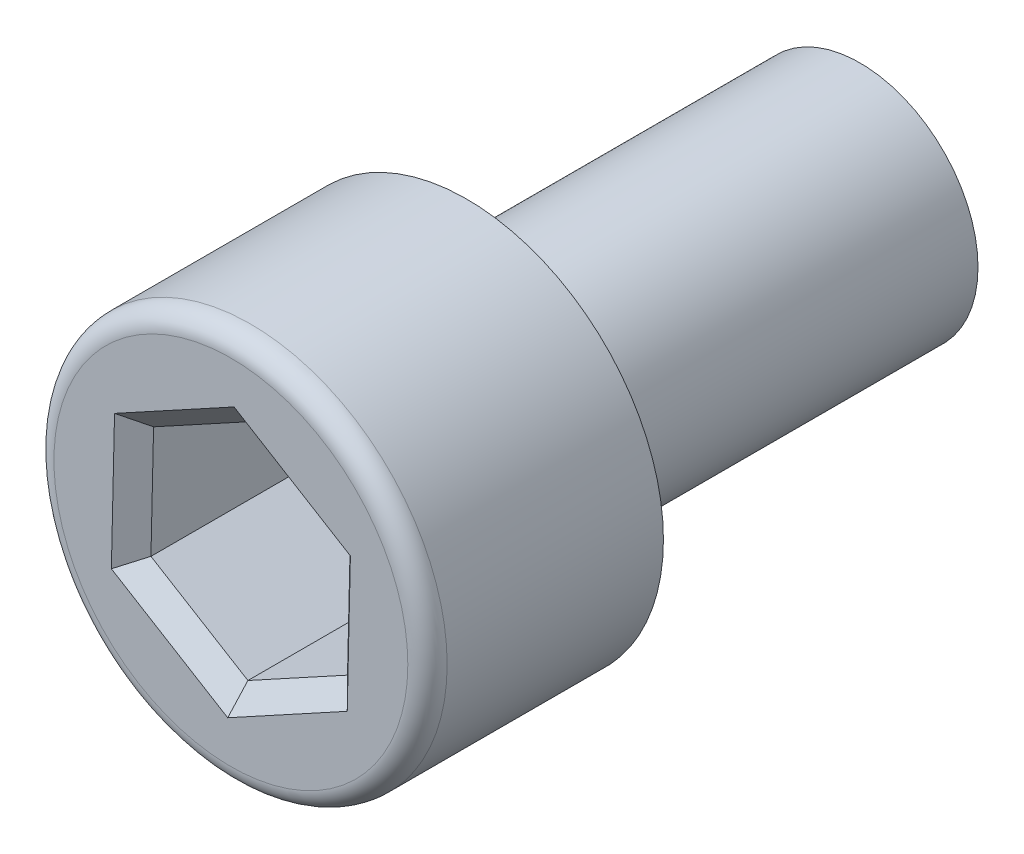
ISO-10303-21;
HEADER;
FILE_DESCRIPTION(('STEP AP214'),'2;1');
FILE_NAME('part.step','',(''),(''),'','','');
FILE_SCHEMA(('AUTOMOTIVE_DESIGN { 1 0 10303 214 1 1 1 1 }'));
ENDSEC;
DATA;
#1=APPLICATION_CONTEXT('core data for automotive mechanical design processes');
#2=APPLICATION_PROTOCOL_DEFINITION('international standard','automotive_design',2000,#1);
#3=PRODUCT_CONTEXT('',#1,'mechanical');
#4=PRODUCT('Part','Part','',(#3));
#5=PRODUCT_RELATED_PRODUCT_CATEGORY('part','',(#4));
#6=PRODUCT_DEFINITION_FORMATION('','',#4);
#7=PRODUCT_DEFINITION_CONTEXT('part definition',#1,'design');
#8=PRODUCT_DEFINITION('design','',#6,#7);
#9=PRODUCT_DEFINITION_SHAPE('','',#8);
#10=(LENGTH_UNIT() NAMED_UNIT(*) SI_UNIT(.MILLI.,.METRE.));
#11=(NAMED_UNIT(*) PLANE_ANGLE_UNIT() SI_UNIT($,.RADIAN.));
#12=(NAMED_UNIT(*) SI_UNIT($,.STERADIAN.) SOLID_ANGLE_UNIT());
#13=UNCERTAINTY_MEASURE_WITH_UNIT(LENGTH_MEASURE(1.E-05),#10,'distance_accuracy_value','');
#14=(GEOMETRIC_REPRESENTATION_CONTEXT(3) GLOBAL_UNCERTAINTY_ASSIGNED_CONTEXT((#13)) GLOBAL_UNIT_ASSIGNED_CONTEXT((#10,
#11,#12)) REPRESENTATION_CONTEXT('',''));
#15=CARTESIAN_POINT('',(0.,0.,0.));
#16=DIRECTION('',(0.,0.,1.));
#17=DIRECTION('',(1.,0.,0.));
#18=AXIS2_PLACEMENT_3D('',#15,#16,#17);
#19=CARTESIAN_POINT('',(0.,0.,-10.));
#20=DIRECTION('',(0.,0.,1.));
#21=DIRECTION('',(1.,0.,0.));
#22=AXIS2_PLACEMENT_3D('',#19,#20,#21);
#23=CYLINDRICAL_SURFACE('',#22,3.);
#24=CARTESIAN_POINT('',(0.,0.,-10.));
#25=DIRECTION('',(0.,0.,1.));
#26=DIRECTION('',(1.,0.,0.));
#27=AXIS2_PLACEMENT_3D('',#24,#25,#26);
#28=CIRCLE('',#27,3.);
#29=CARTESIAN_POINT('',(3.,0.,-10.));
#30=VERTEX_POINT('',#29);
#31=EDGE_CURVE('E158',#30,#30,#28,.T.);
#32=ORIENTED_EDGE('',*,*,#31,.T.);
#33=EDGE_LOOP('',(#32));
#34=FACE_BOUND('',#33,.T.);
#35=CARTESIAN_POINT('',(0.,0.,0.));
#36=DIRECTION('',(0.,0.,1.));
#37=DIRECTION('',(1.,0.,0.));
#38=AXIS2_PLACEMENT_3D('',#35,#36,#37);
#39=CIRCLE('',#38,3.);
#40=CARTESIAN_POINT('',(3.,0.,0.));
#41=VERTEX_POINT('',#40);
#42=EDGE_CURVE('E155',#41,#41,#39,.T.);
#43=ORIENTED_EDGE('',*,*,#42,.F.);
#44=EDGE_LOOP('',(#43));
#45=FACE_BOUND('',#44,.T.);
#46=ADVANCED_FACE('F34',(#34,#45),#23,.T.);
#47=CARTESIAN_POINT('',(0.,0.,-10.));
#48=DIRECTION('',(0.,0.,1.));
#49=DIRECTION('',(1.,0.,0.));
#50=AXIS2_PLACEMENT_3D('',#47,#48,#49);
#51=PLANE('',#50);
#52=ORIENTED_EDGE('',*,*,#31,.F.);
#53=EDGE_LOOP('',(#52));
#54=FACE_BOUND('',#53,.T.);
#55=ADVANCED_FACE('F252',(#54),#51,.F.);
#56=CARTESIAN_POINT('',(0.,0.,6.));
#57=DIRECTION('',(0.,0.,-1.));
#58=DIRECTION('',(-1.,0.,0.));
#59=AXIS2_PLACEMENT_3D('',#56,#57,#58);
#60=CYLINDRICAL_SURFACE('',#59,5.);
#61=CARTESIAN_POINT('',(0.,0.,5.5));
#62=DIRECTION('',(0.,0.,1.));
#63=DIRECTION('',(1.,0.,0.));
#64=AXIS2_PLACEMENT_3D('',#61,#62,#63);
#65=CIRCLE('',#64,5.);
#66=CARTESIAN_POINT('',(5.,0.,5.5));
#67=VERTEX_POINT('',#66);
#68=EDGE_CURVE('E164',#67,#67,#65,.F.);
#69=ORIENTED_EDGE('',*,*,#68,.T.);
#70=EDGE_LOOP('',(#69));
#71=FACE_BOUND('',#70,.T.);
#72=CARTESIAN_POINT('',(0.,0.,0.));
#73=DIRECTION('',(0.,0.,1.));
#74=DIRECTION('',(1.,0.,0.));
#75=AXIS2_PLACEMENT_3D('',#72,#73,#74);
#76=CIRCLE('',#75,5.);
#77=CARTESIAN_POINT('',(5.,0.,0.));
#78=VERTEX_POINT('',#77);
#79=EDGE_CURVE('E144',#78,#78,#76,.T.);
#80=ORIENTED_EDGE('',*,*,#79,.T.);
#81=EDGE_LOOP('',(#80));
#82=FACE_BOUND('',#81,.T.);
#83=ADVANCED_FACE('F236',(#71,#82),#60,.T.);
#84=CARTESIAN_POINT('',(0.,0.,6.));
#85=DIRECTION('',(0.,0.,1.));
#86=DIRECTION('',(1.,0.,0.));
#87=AXIS2_PLACEMENT_3D('',#84,#85,#86);
#88=PLANE('',#87);
#89=DIRECTION('',(-0.854139669217899,0.520043676500676,0.));
#90=VECTOR('',#89,1.);
#91=CARTESIAN_POINT('',(-2.79297544937326,-1.81180061610863,6.));
#92=LINE('',#91,#90);
#93=CARTESIAN_POINT('',(-0.0807177256565525,-3.46316107750778,6.));
#94=VERTEX_POINT('',#93);
#95=CARTESIAN_POINT('',(-3.03954433334751,-1.66167693779962,6.));
#96=VERTEX_POINT('',#95);
#97=EDGE_CURVE('E177',#94,#96,#92,.T.);
#98=ORIENTED_EDGE('',*,*,#97,.T.);
#99=DIRECTION('',(0.0233012003180923,0.999728490173075,0.));
#100=VECTOR('',#99,1.);
#101=CARTESIAN_POINT('',(-2.965553084829,1.51288738324918,6.));
#102=LINE('',#101,#100);
#103=CARTESIAN_POINT('',(-2.95882660769095,1.80148413970817,6.));
#104=VERTEX_POINT('',#103);
#105=EDGE_CURVE('E179',#96,#104,#102,.T.);
#106=ORIENTED_EDGE('',*,*,#105,.T.);
#107=DIRECTION('',(0.877440869535991,0.4796848136724,0.));
#108=VECTOR('',#107,1.);
#109=CARTESIAN_POINT('',(-0.172577635455743,3.32468799935781,6.));
#110=LINE('',#109,#108);
#111=CARTESIAN_POINT('',(0.0807177256565515,3.46316107750778,6.));
#112=VERTEX_POINT('',#111);
#113=EDGE_CURVE('E169',#104,#112,#110,.T.);
#114=ORIENTED_EDGE('',*,*,#113,.T.);
#115=DIRECTION('',(0.854139669217899,-0.520043676500675,0.));
#116=VECTOR('',#115,1.);
#117=CARTESIAN_POINT('',(2.79297544937326,1.81180061610863,6.));
#118=LINE('',#117,#116);
#119=CARTESIAN_POINT('',(3.0395443333475,1.66167693779962,6.));
#120=VERTEX_POINT('',#119);
#121=EDGE_CURVE('E171',#112,#120,#118,.T.);
#122=ORIENTED_EDGE('',*,*,#121,.T.);
#123=DIRECTION('',(-0.023301200318092,-0.999728490173075,0.));
#124=VECTOR('',#123,1.);
#125=CARTESIAN_POINT('',(2.965553084829,-1.51288738324918,6.));
#126=LINE('',#125,#124);
#127=CARTESIAN_POINT('',(2.95882660769095,-1.80148413970817,6.));
#128=VERTEX_POINT('',#127);
#129=EDGE_CURVE('E173',#120,#128,#126,.T.);
#130=ORIENTED_EDGE('',*,*,#129,.T.);
#131=DIRECTION('',(-0.877440869535991,-0.4796848136724,0.));
#132=VECTOR('',#131,1.);
#133=CARTESIAN_POINT('',(0.172577635455742,-3.32468799935782,6.));
#134=LINE('',#133,#132);
#135=EDGE_CURVE('E175',#128,#94,#134,.T.);
#136=ORIENTED_EDGE('',*,*,#135,.T.);
#137=EDGE_LOOP('',(#98,#106,#114,#122,#130,#136));
#138=FACE_BOUND('',#137,.T.);
#139=CARTESIAN_POINT('',(0.,0.,6.));
#140=DIRECTION('',(0.,0.,1.));
#141=DIRECTION('',(1.,0.,0.));
#142=AXIS2_PLACEMENT_3D('',#139,#140,#141);
#143=CIRCLE('',#142,4.5);
#144=CARTESIAN_POINT('',(4.5,0.,6.));
#145=VERTEX_POINT('',#144);
#146=EDGE_CURVE('E161',#145,#145,#143,.T.);
#147=ORIENTED_EDGE('',*,*,#146,.T.);
#148=EDGE_LOOP('',(#147));
#149=FACE_BOUND('',#148,.T.);
#150=ADVANCED_FACE('F232',(#138,#149),#88,.T.);
#151=CARTESIAN_POINT('',(0.,0.,0.));
#152=DIRECTION('',(0.,0.,1.));
#153=DIRECTION('',(1.,0.,0.));
#154=AXIS2_PLACEMENT_3D('',#151,#152,#153);
#155=PLANE('',#154);
#156=ORIENTED_EDGE('',*,*,#42,.T.);
#157=EDGE_LOOP('',(#156));
#158=FACE_BOUND('',#157,.T.);
#159=ORIENTED_EDGE('',*,*,#79,.F.);
#160=EDGE_LOOP('',(#159));
#161=FACE_BOUND('',#160,.T.);
#162=ADVANCED_FACE('F235',(#158,#161),#155,.F.);
#163=CARTESIAN_POINT('',(0.0672647713804591,2.88596756458981,0.));
#164=DIRECTION('',(-0.4796848136724,0.877440869535991,0.));
#165=DIRECTION('',(-0.877440869535991,-0.4796848136724,0.));
#166=AXIS2_PLACEMENT_3D('',#163,#164,#165);
#167=PLANE('',#166);
#168=DIRECTION('',(0.,0.,1.));
#169=VECTOR('',#168,1.);
#170=CARTESIAN_POINT('',(0.0672647713804591,2.88596756458981,0.));
#171=LINE('',#170,#169);
#172=CARTESIAN_POINT('',(0.0672647713804591,2.88596756458981,0.));
#173=VERTEX_POINT('',#172);
#174=CARTESIAN_POINT('',(0.0672647713804591,2.88596756458981,5.5));
#175=VERTEX_POINT('',#174);
#176=EDGE_CURVE('E142',#173,#175,#171,.T.);
#177=ORIENTED_EDGE('',*,*,#176,.T.);
#178=DIRECTION('',(-0.877440869535991,-0.4796848136724,0.));
#179=VECTOR('',#178,1.);
#180=CARTESIAN_POINT('',(-2.46568883974246,1.50123678309014,5.5));
#181=LINE('',#180,#179);
#182=CARTESIAN_POINT('',(-2.46568883974246,1.50123678309014,5.5));
#183=VERTEX_POINT('',#182);
#184=EDGE_CURVE('E11',#175,#183,#181,.T.);
#185=ORIENTED_EDGE('',*,*,#184,.T.);
#186=DIRECTION('',(0.,0.,1.));
#187=VECTOR('',#186,1.);
#188=CARTESIAN_POINT('',(-2.46568883974246,1.50123678309014,0.));
#189=LINE('',#188,#187);
#190=CARTESIAN_POINT('',(-2.46568883974246,1.50123678309014,0.));
#191=VERTEX_POINT('',#190);
#192=EDGE_CURVE('E103',#191,#183,#189,.T.);
#193=ORIENTED_EDGE('',*,*,#192,.F.);
#194=DIRECTION('',(-0.877440869535991,-0.4796848136724,0.));
#195=VECTOR('',#194,1.);
#196=CARTESIAN_POINT('',(0.0672647713804591,2.88596756458981,0.));
#197=LINE('',#196,#195);
#198=EDGE_CURVE('E107',#173,#191,#197,.T.);
#199=ORIENTED_EDGE('',*,*,#198,.F.);
#200=EDGE_LOOP('',(#177,#185,#193,#199));
#201=FACE_BOUND('',#200,.T.);
#202=ADVANCED_FACE('F105',(#201),#167,.F.);
#203=CARTESIAN_POINT('',(2.53295361112292,1.38473078149968,0.));
#204=DIRECTION('',(0.520043676500675,0.854139669217899,0.));
#205=DIRECTION('',(-0.854139669217899,0.520043676500675,0.));
#206=AXIS2_PLACEMENT_3D('',#203,#204,#205);
#207=PLANE('',#206);
#208=DIRECTION('',(0.,0.,1.));
#209=VECTOR('',#208,1.);
#210=CARTESIAN_POINT('',(2.53295361112292,1.38473078149968,0.));
#211=LINE('',#210,#209);
#212=CARTESIAN_POINT('',(2.53295361112292,1.38473078149968,0.));
#213=VERTEX_POINT('',#212);
#214=CARTESIAN_POINT('',(2.53295361112292,1.38473078149968,5.5));
#215=VERTEX_POINT('',#214);
#216=EDGE_CURVE('E145',#213,#215,#211,.T.);
#217=ORIENTED_EDGE('',*,*,#216,.T.);
#218=DIRECTION('',(-0.854139669217899,0.520043676500675,0.));
#219=VECTOR('',#218,1.);
#220=CARTESIAN_POINT('',(0.0672647713804589,2.88596756458981,5.5));
#221=LINE('',#220,#219);
#222=EDGE_CURVE('E41',#215,#175,#221,.T.);
#223=ORIENTED_EDGE('',*,*,#222,.T.);
#224=ORIENTED_EDGE('',*,*,#176,.F.);
#225=DIRECTION('',(-0.854139669217899,0.520043676500675,0.));
#226=VECTOR('',#225,1.);
#227=CARTESIAN_POINT('',(2.53295361112292,1.38473078149968,0.));
#228=LINE('',#227,#226);
#229=EDGE_CURVE('E114',#213,#173,#228,.T.);
#230=ORIENTED_EDGE('',*,*,#229,.F.);
#231=EDGE_LOOP('',(#217,#223,#224,#230));
#232=FACE_BOUND('',#231,.T.);
#233=ADVANCED_FACE('F223',(#232),#207,.F.);
#234=CARTESIAN_POINT('',(2.46568883974246,-1.50123678309014,0.));
#235=DIRECTION('',(0.999728490173075,-0.023301200318092,0.));
#236=DIRECTION('',(0.023301200318092,0.999728490173075,0.));
#237=AXIS2_PLACEMENT_3D('',#234,#235,#236);
#238=PLANE('',#237);
#239=DIRECTION('',(0.,0.,1.));
#240=VECTOR('',#239,1.);
#241=CARTESIAN_POINT('',(2.46568883974246,-1.50123678309014,0.));
#242=LINE('',#241,#240);
#243=CARTESIAN_POINT('',(2.46568883974246,-1.50123678309014,0.));
#244=VERTEX_POINT('',#243);
#245=CARTESIAN_POINT('',(2.46568883974246,-1.50123678309014,5.5));
#246=VERTEX_POINT('',#245);
#247=EDGE_CURVE('E147',#244,#246,#242,.T.);
#248=ORIENTED_EDGE('',*,*,#247,.T.);
#249=DIRECTION('',(0.023301200318092,0.999728490173075,0.));
#250=VECTOR('',#249,1.);
#251=CARTESIAN_POINT('',(2.53295361112292,1.38473078149968,5.5));
#252=LINE('',#251,#250);
#253=EDGE_CURVE('E55',#246,#215,#252,.T.);
#254=ORIENTED_EDGE('',*,*,#253,.T.);
#255=ORIENTED_EDGE('',*,*,#216,.F.);
#256=DIRECTION('',(0.023301200318092,0.999728490173075,0.));
#257=VECTOR('',#256,1.);
#258=CARTESIAN_POINT('',(2.46568883974246,-1.50123678309014,0.));
#259=LINE('',#258,#257);
#260=EDGE_CURVE('E139',#244,#213,#259,.T.);
#261=ORIENTED_EDGE('',*,*,#260,.F.);
#262=EDGE_LOOP('',(#248,#254,#255,#261));
#263=FACE_BOUND('',#262,.T.);
#264=ADVANCED_FACE('F195',(#263),#238,.F.);
#265=CARTESIAN_POINT('',(-0.0672647713804604,-2.88596756458982,0.));
#266=DIRECTION('',(0.4796848136724,-0.87744086953599,0.));
#267=DIRECTION('',(0.877440869535991,0.4796848136724,0.));
#268=AXIS2_PLACEMENT_3D('',#265,#266,#267);
#269=PLANE('',#268);
#270=DIRECTION('',(0.,0.,1.));
#271=VECTOR('',#270,1.);
#272=CARTESIAN_POINT('',(-0.0672647713804604,-2.88596756458982,0.));
#273=LINE('',#272,#271);
#274=CARTESIAN_POINT('',(-0.0672647713804604,-2.88596756458982,0.));
#275=VERTEX_POINT('',#274);
#276=CARTESIAN_POINT('',(-0.0672647713804604,-2.88596756458982,5.5));
#277=VERTEX_POINT('',#276);
#278=EDGE_CURVE('E149',#275,#277,#273,.T.);
#279=ORIENTED_EDGE('',*,*,#278,.T.);
#280=DIRECTION('',(0.877440869535991,0.4796848136724,0.));
#281=VECTOR('',#280,1.);
#282=CARTESIAN_POINT('',(2.46568883974246,-1.50123678309014,5.5));
#283=LINE('',#282,#281);
#284=EDGE_CURVE('E184',#277,#246,#283,.T.);
#285=ORIENTED_EDGE('',*,*,#284,.T.);
#286=ORIENTED_EDGE('',*,*,#247,.F.);
#287=DIRECTION('',(0.877440869535991,0.4796848136724,0.));
#288=VECTOR('',#287,1.);
#289=CARTESIAN_POINT('',(-0.0672647713804604,-2.88596756458982,0.));
#290=LINE('',#289,#288);
#291=EDGE_CURVE('E136',#275,#244,#290,.T.);
#292=ORIENTED_EDGE('',*,*,#291,.F.);
#293=EDGE_LOOP('',(#279,#285,#286,#292));
#294=FACE_BOUND('',#293,.T.);
#295=ADVANCED_FACE('F188',(#294),#269,.F.);
#296=CARTESIAN_POINT('',(-2.53295361112292,-1.38473078149968,0.));
#297=DIRECTION('',(-0.520043676500675,-0.854139669217898,0.));
#298=DIRECTION('',(0.854139669217899,-0.520043676500676,0.));
#299=AXIS2_PLACEMENT_3D('',#296,#297,#298);
#300=PLANE('',#299);
#301=DIRECTION('',(0.,0.,1.));
#302=VECTOR('',#301,1.);
#303=CARTESIAN_POINT('',(-2.53295361112292,-1.38473078149968,0.));
#304=LINE('',#303,#302);
#305=CARTESIAN_POINT('',(-2.53295361112292,-1.38473078149968,0.));
#306=VERTEX_POINT('',#305);
#307=CARTESIAN_POINT('',(-2.53295361112292,-1.38473078149968,5.5));
#308=VERTEX_POINT('',#307);
#309=EDGE_CURVE('E113',#306,#308,#304,.T.);
#310=ORIENTED_EDGE('',*,*,#309,.T.);
#311=DIRECTION('',(0.854139669217899,-0.520043676500676,0.));
#312=VECTOR('',#311,1.);
#313=CARTESIAN_POINT('',(-0.0672647713804605,-2.88596756458982,5.5));
#314=LINE('',#313,#312);
#315=EDGE_CURVE('E182',#308,#277,#314,.T.);
#316=ORIENTED_EDGE('',*,*,#315,.T.);
#317=ORIENTED_EDGE('',*,*,#278,.F.);
#318=DIRECTION('',(0.854139669217898,-0.520043676500675,0.));
#319=VECTOR('',#318,1.);
#320=CARTESIAN_POINT('',(-2.53295361112292,-1.38473078149968,0.));
#321=LINE('',#320,#319);
#322=EDGE_CURVE('E123',#306,#275,#321,.T.);
#323=ORIENTED_EDGE('',*,*,#322,.F.);
#324=EDGE_LOOP('',(#310,#316,#317,#323));
#325=FACE_BOUND('',#324,.T.);
#326=ADVANCED_FACE('F222',(#325),#300,.F.);
#327=CARTESIAN_POINT('',(-2.46568883974246,1.50123678309014,0.));
#328=DIRECTION('',(-0.999728490173075,0.0233012003180923,0.));
#329=DIRECTION('',(-0.0233012003180923,-0.999728490173075,0.));
#330=AXIS2_PLACEMENT_3D('',#327,#328,#329);
#331=PLANE('',#330);
#332=ORIENTED_EDGE('',*,*,#192,.T.);
#333=DIRECTION('',(-0.0233012003180923,-0.999728490173075,0.));
#334=VECTOR('',#333,1.);
#335=CARTESIAN_POINT('',(-2.53295361112292,-1.38473078149968,5.5));
#336=LINE('',#335,#334);
#337=EDGE_CURVE('E167',#183,#308,#336,.T.);
#338=ORIENTED_EDGE('',*,*,#337,.T.);
#339=ORIENTED_EDGE('',*,*,#309,.F.);
#340=DIRECTION('',(-0.0233012003180923,-0.999728490173075,0.));
#341=VECTOR('',#340,1.);
#342=CARTESIAN_POINT('',(-2.46568883974246,1.50123678309014,0.));
#343=LINE('',#342,#341);
#344=EDGE_CURVE('E117',#191,#306,#343,.T.);
#345=ORIENTED_EDGE('',*,*,#344,.F.);
#346=EDGE_LOOP('',(#332,#338,#339,#345));
#347=FACE_BOUND('',#346,.T.);
#348=ADVANCED_FACE('F118',(#347),#331,.F.);
#349=CARTESIAN_POINT('',(-4.99864245086537,0.11650600159046,0.));
#350=DIRECTION('',(0.,0.,1.));
#351=DIRECTION('',(1.,0.,0.));
#352=AXIS2_PLACEMENT_3D('',#349,#350,#351);
#353=PLANE('',#352);
#354=ORIENTED_EDGE('',*,*,#198,.T.);
#355=ORIENTED_EDGE('',*,*,#344,.T.);
#356=ORIENTED_EDGE('',*,*,#322,.T.);
#357=ORIENTED_EDGE('',*,*,#291,.T.);
#358=ORIENTED_EDGE('',*,*,#260,.T.);
#359=ORIENTED_EDGE('',*,*,#229,.T.);
#360=EDGE_LOOP('',(#354,#355,#356,#357,#358,#359));
#361=FACE_BOUND('',#360,.T.);
#362=ADVANCED_FACE('F125',(#361),#353,.T.);
#363=CARTESIAN_POINT('',(0.,0.,5.5));
#364=DIRECTION('',(0.,0.,1.));
#365=DIRECTION('',(1.,0.,0.));
#366=AXIS2_PLACEMENT_3D('',#363,#364,#365);
#367=TOROIDAL_SURFACE('',#366,4.5,0.5);
#368=ORIENTED_EDGE('',*,*,#68,.F.);
#369=EDGE_LOOP('',(#368));
#370=FACE_BOUND('',#369,.T.);
#371=ORIENTED_EDGE('',*,*,#146,.F.);
#372=EDGE_LOOP('',(#371));
#373=FACE_BOUND('',#372,.T.);
#374=ADVANCED_FACE('F240',(#370,#373),#367,.T.);
#375=CARTESIAN_POINT('',(2.46568883974246,-1.50123678309014,5.5));
#376=DIRECTION('',(-0.706914794746768,0.016476436754709,0.707106781186549));
#377=DIRECTION('',(0.707202780921329,0.,0.707010768416677));
#378=AXIS2_PLACEMENT_3D('',#375,#376,#377);
#379=PLANE('',#378);
#380=DIRECTION('',(0.645668899904438,-0.393116068260719,0.654653670707975));
#381=VECTOR('',#380,1.);
#382=CARTESIAN_POINT('',(1.76120631410175,-1.07231198792152,4.78571428571429));
#383=LINE('',#382,#381);
#384=EDGE_CURVE('E131',#128,#246,#383,.F.);
#385=ORIENTED_EDGE('',*,*,#384,.F.);
#386=ORIENTED_EDGE('',*,*,#129,.F.);
#387=DIRECTION('',(0.663282951701859,0.362607635620438,0.654653670707975));
#388=VECTOR('',#387,1.);
#389=CARTESIAN_POINT('',(1.80925257937351,0.989093415356909,4.78571428571428));
#390=LINE('',#389,#388);
#391=EDGE_CURVE('E128',#215,#120,#390,.T.);
#392=ORIENTED_EDGE('',*,*,#391,.F.);
#393=ORIENTED_EDGE('',*,*,#253,.F.);
#394=EDGE_LOOP('',(#385,#386,#392,#393));
#395=FACE_BOUND('',#394,.T.);
#396=ADVANCED_FACE('F199',(#395),#379,.T.);
#397=CARTESIAN_POINT('',(2.53295361112292,1.38473078149968,5.5));
#398=DIRECTION('',(-0.36772641016681,-0.603967952184409,0.70710678118655));
#399=DIRECTION('',(0.,-0.760383816102434,-0.649473981164372));
#400=AXIS2_PLACEMENT_3D('',#397,#398,#399);
#401=PLANE('',#400);
#402=ORIENTED_EDGE('',*,*,#391,.T.);
#403=ORIENTED_EDGE('',*,*,#121,.F.);
#404=DIRECTION('',(0.0176140517974212,0.755723703881155,0.654653670707975));
#405=VECTOR('',#404,1.);
#406=CARTESIAN_POINT('',(0.0480462652717555,2.06140540327844,4.78571428571429));
#407=LINE('',#406,#405);
#408=EDGE_CURVE('E203',#175,#112,#407,.T.);
#409=ORIENTED_EDGE('',*,*,#408,.F.);
#410=ORIENTED_EDGE('',*,*,#222,.F.);
#411=EDGE_LOOP('',(#402,#403,#409,#410));
#412=FACE_BOUND('',#411,.T.);
#413=ADVANCED_FACE('F227',(#412),#401,.T.);
#414=CARTESIAN_POINT('',(-0.0672647713804604,-2.88596756458982,5.5));
#415=DIRECTION('',(-0.339188384579958,0.620444388939118,0.70710678118655));
#416=DIRECTION('',(0.,-0.751666735319627,0.659543113840129));
#417=AXIS2_PLACEMENT_3D('',#414,#415,#416);
#418=PLANE('',#417);
#419=ORIENTED_EDGE('',*,*,#384,.T.);
#420=ORIENTED_EDGE('',*,*,#284,.F.);
#421=DIRECTION('',(-0.0176140517974203,-0.755723703881155,0.654653670707975));
#422=VECTOR('',#421,1.);
#423=CARTESIAN_POINT('',(-0.0480462652717581,-2.06140540327844,4.78571428571428));
#424=LINE('',#423,#422);
#425=EDGE_CURVE('E205',#94,#277,#424,.F.);
#426=ORIENTED_EDGE('',*,*,#425,.F.);
#427=ORIENTED_EDGE('',*,*,#135,.F.);
#428=EDGE_LOOP('',(#419,#420,#426,#427));
#429=FACE_BOUND('',#428,.T.);
#430=ADVANCED_FACE('F202',(#429),#418,.T.);
#431=CARTESIAN_POINT('',(0.0672647713804591,2.88596756458981,5.5));
#432=DIRECTION('',(0.339188384579959,-0.620444388939118,0.707106781186549));
#433=DIRECTION('',(0.,-0.751666735319627,-0.65954311384013));
#434=AXIS2_PLACEMENT_3D('',#431,#432,#433);
#435=PLANE('',#434);
#436=ORIENTED_EDGE('',*,*,#408,.T.);
#437=ORIENTED_EDGE('',*,*,#113,.F.);
#438=DIRECTION('',(0.645668899904438,-0.393116068260718,-0.654653670707975));
#439=VECTOR('',#438,1.);
#440=CARTESIAN_POINT('',(-2.46568883974246,1.50123678309014,5.5));
#441=LINE('',#440,#439);
#442=EDGE_CURVE('E209',#183,#104,#441,.F.);
#443=ORIENTED_EDGE('',*,*,#442,.F.);
#444=ORIENTED_EDGE('',*,*,#184,.F.);
#445=EDGE_LOOP('',(#436,#437,#443,#444));
#446=FACE_BOUND('',#445,.T.);
#447=ADVANCED_FACE('F230',(#446),#435,.T.);
#448=CARTESIAN_POINT('',(-2.53295361112292,-1.38473078149968,5.5));
#449=DIRECTION('',(0.36772641016681,0.603967952184409,0.70710678118655));
#450=DIRECTION('',(0.,-0.760383816102434,0.649473981164372));
#451=AXIS2_PLACEMENT_3D('',#448,#449,#450);
#452=PLANE('',#451);
#453=ORIENTED_EDGE('',*,*,#425,.T.);
#454=ORIENTED_EDGE('',*,*,#315,.F.);
#455=DIRECTION('',(-0.663282951701859,-0.362607635620437,0.654653670707975));
#456=VECTOR('',#455,1.);
#457=CARTESIAN_POINT('',(-1.80925257937351,-0.989093415356909,4.78571428571428));
#458=LINE('',#457,#456);
#459=EDGE_CURVE('E211',#96,#308,#458,.F.);
#460=ORIENTED_EDGE('',*,*,#459,.F.);
#461=ORIENTED_EDGE('',*,*,#97,.F.);
#462=EDGE_LOOP('',(#453,#454,#460,#461));
#463=FACE_BOUND('',#462,.T.);
#464=ADVANCED_FACE('F220',(#463),#452,.T.);
#465=CARTESIAN_POINT('',(-2.46568883974246,1.50123678309014,5.5));
#466=DIRECTION('',(0.706914794746768,-0.0164764367547092,0.707106781186549));
#467=DIRECTION('',(0.707202780921329,0.,-0.707010768416677));
#468=AXIS2_PLACEMENT_3D('',#465,#466,#467);
#469=PLANE('',#468);
#470=ORIENTED_EDGE('',*,*,#442,.T.);
#471=ORIENTED_EDGE('',*,*,#105,.F.);
#472=ORIENTED_EDGE('',*,*,#459,.T.);
#473=ORIENTED_EDGE('',*,*,#337,.F.);
#474=EDGE_LOOP('',(#470,#471,#472,#473));
#475=FACE_BOUND('',#474,.T.);
#476=ADVANCED_FACE('F217',(#475),#469,.T.);
#477=CLOSED_SHELL('',(#46,#55,#83,#150,#162,#202,#233,#264,#295,#326,#348,#362,#374,#396,#413,
#430,#447,#464,#476));
#478=MANIFOLD_SOLID_BREP('B2',#477);
#479=ADVANCED_BREP_SHAPE_REPRESENTATION('',(#18,#478),#14);
#480=SHAPE_DEFINITION_REPRESENTATION(#9,#479);
ENDSEC;
END-ISO-10303-21;
